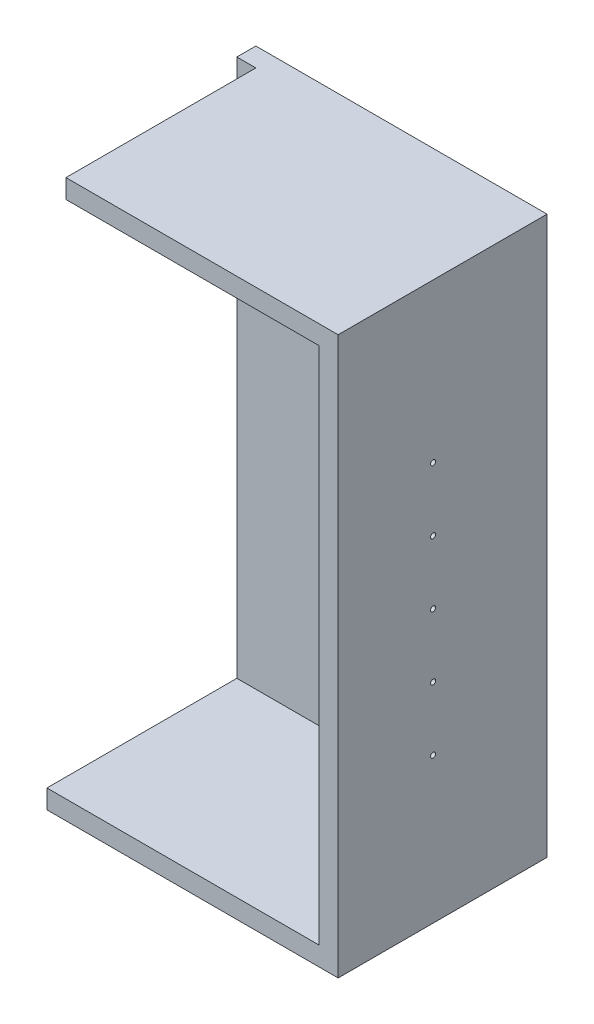
ISO-10303-21;
HEADER;
FILE_DESCRIPTION(('STEP AP214'),'2;1');
FILE_NAME('part.step','',(''),(''),'','','');
FILE_SCHEMA(('AUTOMOTIVE_DESIGN { 1 0 10303 214 1 1 1 1 }'));
ENDSEC;
DATA;
#1=APPLICATION_CONTEXT('core data for automotive mechanical design processes');
#2=APPLICATION_PROTOCOL_DEFINITION('international standard','automotive_design',2000,#1);
#3=PRODUCT_CONTEXT('',#1,'mechanical');
#4=PRODUCT('Part','Part','',(#3));
#5=PRODUCT_RELATED_PRODUCT_CATEGORY('part','',(#4));
#6=PRODUCT_DEFINITION_FORMATION('','',#4);
#7=PRODUCT_DEFINITION_CONTEXT('part definition',#1,'design');
#8=PRODUCT_DEFINITION('design','',#6,#7);
#9=PRODUCT_DEFINITION_SHAPE('','',#8);
#10=(LENGTH_UNIT() NAMED_UNIT(*) SI_UNIT(.MILLI.,.METRE.));
#11=(NAMED_UNIT(*) PLANE_ANGLE_UNIT() SI_UNIT($,.RADIAN.));
#12=(NAMED_UNIT(*) SI_UNIT($,.STERADIAN.) SOLID_ANGLE_UNIT());
#13=UNCERTAINTY_MEASURE_WITH_UNIT(LENGTH_MEASURE(1.E-05),#10,'distance_accuracy_value','');
#14=(GEOMETRIC_REPRESENTATION_CONTEXT(3) GLOBAL_UNCERTAINTY_ASSIGNED_CONTEXT((#13)) GLOBAL_UNIT_ASSIGNED_CONTEXT((#10,
#11,#12)) REPRESENTATION_CONTEXT('',''));
#15=CARTESIAN_POINT('',(0.,0.,0.));
#16=DIRECTION('',(0.,0.,1.));
#17=DIRECTION('',(1.,0.,0.));
#18=AXIS2_PLACEMENT_3D('',#15,#16,#17);
#19=CARTESIAN_POINT('',(0.,0.,300.));
#20=DIRECTION('',(0.,0.,1.));
#21=DIRECTION('',(1.,0.,0.));
#22=AXIS2_PLACEMENT_3D('',#19,#20,#21);
#23=PLANE('',#22);
#24=DIRECTION('',(1.,0.,0.));
#25=VECTOR('',#24,1.);
#26=CARTESIAN_POINT('',(-200.,-410.,300.));
#27=LINE('',#26,#25);
#28=CARTESIAN_POINT('',(-230.,-410.,300.));
#29=VERTEX_POINT('',#28);
#30=CARTESIAN_POINT('',(200.,-410.,300.));
#31=VERTEX_POINT('',#30);
#32=EDGE_CURVE('E163',#29,#31,#27,.T.);
#33=ORIENTED_EDGE('',*,*,#32,.F.);
#34=DIRECTION('',(0.,-1.,0.));
#35=VECTOR('',#34,1.);
#36=CARTESIAN_POINT('',(-230.,-440.,300.));
#37=LINE('',#36,#35);
#38=CARTESIAN_POINT('',(-230.,-440.,300.));
#39=VERTEX_POINT('',#38);
#40=EDGE_CURVE('E48',#29,#39,#37,.T.);
#41=ORIENTED_EDGE('',*,*,#40,.T.);
#42=DIRECTION('',(1.,0.,0.));
#43=VECTOR('',#42,1.);
#44=CARTESIAN_POINT('',(-230.,-440.,300.));
#45=LINE('',#44,#43);
#46=CARTESIAN_POINT('',(230.,-440.,300.));
#47=VERTEX_POINT('',#46);
#48=EDGE_CURVE('E124',#39,#47,#45,.T.);
#49=ORIENTED_EDGE('',*,*,#48,.T.);
#50=DIRECTION('',(0.,1.,0.));
#51=VECTOR('',#50,1.);
#52=CARTESIAN_POINT('',(230.,-440.,300.));
#53=LINE('',#52,#51);
#54=CARTESIAN_POINT('',(230.,440.,300.));
#55=VERTEX_POINT('',#54);
#56=EDGE_CURVE('E54',#47,#55,#53,.T.);
#57=ORIENTED_EDGE('',*,*,#56,.T.);
#58=DIRECTION('',(-1.,0.,0.));
#59=VECTOR('',#58,1.);
#60=CARTESIAN_POINT('',(-230.,440.,300.));
#61=LINE('',#60,#59);
#62=CARTESIAN_POINT('',(-200.,440.,300.));
#63=VERTEX_POINT('',#62);
#64=EDGE_CURVE('E118',#55,#63,#61,.T.);
#65=ORIENTED_EDGE('',*,*,#64,.T.);
#66=DIRECTION('',(0.,1.,0.));
#67=VECTOR('',#66,1.);
#68=CARTESIAN_POINT('',(-200.,440.,300.));
#69=LINE('',#68,#67);
#70=CARTESIAN_POINT('',(-200.,410.,300.));
#71=VERTEX_POINT('',#70);
#72=EDGE_CURVE('E103',#71,#63,#69,.T.);
#73=ORIENTED_EDGE('',*,*,#72,.F.);
#74=DIRECTION('',(-1.,0.,0.));
#75=VECTOR('',#74,1.);
#76=CARTESIAN_POINT('',(-200.,410.,300.));
#77=LINE('',#76,#75);
#78=CARTESIAN_POINT('',(200.,410.,300.));
#79=VERTEX_POINT('',#78);
#80=EDGE_CURVE('E160',#79,#71,#77,.T.);
#81=ORIENTED_EDGE('',*,*,#80,.F.);
#82=DIRECTION('',(0.,1.,0.));
#83=VECTOR('',#82,1.);
#84=CARTESIAN_POINT('',(200.,-410.,300.));
#85=LINE('',#84,#83);
#86=EDGE_CURVE('E158',#31,#79,#85,.T.);
#87=ORIENTED_EDGE('',*,*,#86,.F.);
#88=EDGE_LOOP('',(#33,#41,#49,#57,#65,#73,#81,#87));
#89=FACE_BOUND('',#88,.T.);
#90=ADVANCED_FACE('F33',(#89),#23,.T.);
#91=CARTESIAN_POINT('',(-230.,-440.,300.));
#92=DIRECTION('',(0.,1.,0.));
#93=DIRECTION('',(0.,0.,1.));
#94=AXIS2_PLACEMENT_3D('',#91,#92,#93);
#95=PLANE('',#94);
#96=DIRECTION('',(0.,0.,-1.));
#97=VECTOR('',#96,1.);
#98=CARTESIAN_POINT('',(-230.,-440.,300.));
#99=LINE('',#98,#97);
#100=CARTESIAN_POINT('',(-230.,-440.,-30.));
#101=VERTEX_POINT('',#100);
#102=EDGE_CURVE('E122',#39,#101,#99,.T.);
#103=ORIENTED_EDGE('',*,*,#102,.T.);
#104=DIRECTION('',(-1.,0.,0.));
#105=VECTOR('',#104,1.);
#106=CARTESIAN_POINT('',(230.,-440.,-30.));
#107=LINE('',#106,#105);
#108=CARTESIAN_POINT('',(230.,-440.,-30.));
#109=VERTEX_POINT('',#108);
#110=EDGE_CURVE('E148',#109,#101,#107,.T.);
#111=ORIENTED_EDGE('',*,*,#110,.F.);
#112=DIRECTION('',(0.,0.,-1.));
#113=VECTOR('',#112,1.);
#114=CARTESIAN_POINT('',(230.,-440.,300.));
#115=LINE('',#114,#113);
#116=EDGE_CURVE('E11',#47,#109,#115,.T.);
#117=ORIENTED_EDGE('',*,*,#116,.F.);
#118=ORIENTED_EDGE('',*,*,#48,.F.);
#119=EDGE_LOOP('',(#103,#111,#117,#118));
#120=FACE_BOUND('',#119,.T.);
#121=ADVANCED_FACE('F35',(#120),#95,.F.);
#122=CARTESIAN_POINT('',(230.,-440.,300.));
#123=DIRECTION('',(-1.,0.,0.));
#124=DIRECTION('',(0.,-1.,0.));
#125=AXIS2_PLACEMENT_3D('',#122,#123,#124);
#126=PLANE('',#125);
#127=CARTESIAN_POINT('',(230.,-210.,150.));
#128=DIRECTION('',(1.,0.,0.));
#129=DIRECTION('',(0.,1.,0.));
#130=AXIS2_PLACEMENT_3D('',#127,#128,#129);
#131=CIRCLE('',#130,3.99999999999999);
#132=CARTESIAN_POINT('',(230.,-206.,150.));
#133=VERTEX_POINT('',#132);
#134=EDGE_CURVE('E189',#133,#133,#131,.T.);
#135=ORIENTED_EDGE('',*,*,#134,.F.);
#136=EDGE_LOOP('',(#135));
#137=FACE_BOUND('',#136,.T.);
#138=CARTESIAN_POINT('',(230.,-110.,150.));
#139=DIRECTION('',(1.,0.,0.));
#140=DIRECTION('',(0.,1.,0.));
#141=AXIS2_PLACEMENT_3D('',#138,#139,#140);
#142=CIRCLE('',#141,3.99999999999999);
#143=CARTESIAN_POINT('',(230.,-106.,150.));
#144=VERTEX_POINT('',#143);
#145=EDGE_CURVE('E199',#144,#144,#142,.T.);
#146=ORIENTED_EDGE('',*,*,#145,.F.);
#147=EDGE_LOOP('',(#146));
#148=FACE_BOUND('',#147,.T.);
#149=CARTESIAN_POINT('',(230.,-10.0000000000001,150.));
#150=DIRECTION('',(1.,0.,0.));
#151=DIRECTION('',(0.,1.,0.));
#152=AXIS2_PLACEMENT_3D('',#149,#150,#151);
#153=CIRCLE('',#152,3.99999999999999);
#154=CARTESIAN_POINT('',(230.,-6.00000000000012,150.));
#155=VERTEX_POINT('',#154);
#156=EDGE_CURVE('E205',#155,#155,#153,.T.);
#157=ORIENTED_EDGE('',*,*,#156,.F.);
#158=EDGE_LOOP('',(#157));
#159=FACE_BOUND('',#158,.T.);
#160=CARTESIAN_POINT('',(230.,89.9999999999999,150.));
#161=DIRECTION('',(1.,0.,0.));
#162=DIRECTION('',(0.,1.,0.));
#163=AXIS2_PLACEMENT_3D('',#160,#161,#162);
#164=CIRCLE('',#163,3.99999999999999);
#165=CARTESIAN_POINT('',(230.,93.9999999999999,150.));
#166=VERTEX_POINT('',#165);
#167=EDGE_CURVE('E211',#166,#166,#164,.T.);
#168=ORIENTED_EDGE('',*,*,#167,.F.);
#169=EDGE_LOOP('',(#168));
#170=FACE_BOUND('',#169,.T.);
#171=CARTESIAN_POINT('',(230.,190.,150.));
#172=DIRECTION('',(1.,0.,0.));
#173=DIRECTION('',(0.,1.,0.));
#174=AXIS2_PLACEMENT_3D('',#171,#172,#173);
#175=CIRCLE('',#174,3.99999999999999);
#176=CARTESIAN_POINT('',(230.,194.,150.));
#177=VERTEX_POINT('',#176);
#178=EDGE_CURVE('E153',#177,#177,#175,.T.);
#179=ORIENTED_EDGE('',*,*,#178,.F.);
#180=EDGE_LOOP('',(#179));
#181=FACE_BOUND('',#180,.T.);
#182=ORIENTED_EDGE('',*,*,#116,.T.);
#183=DIRECTION('',(0.,-1.,0.));
#184=VECTOR('',#183,1.);
#185=CARTESIAN_POINT('',(230.,440.,-30.));
#186=LINE('',#185,#184);
#187=CARTESIAN_POINT('',(230.,440.,-30.));
#188=VERTEX_POINT('',#187);
#189=EDGE_CURVE('E140',#188,#109,#186,.T.);
#190=ORIENTED_EDGE('',*,*,#189,.F.);
#191=DIRECTION('',(0.,0.,-1.));
#192=VECTOR('',#191,1.);
#193=CARTESIAN_POINT('',(230.,440.,300.));
#194=LINE('',#193,#192);
#195=EDGE_CURVE('E41',#55,#188,#194,.T.);
#196=ORIENTED_EDGE('',*,*,#195,.F.);
#197=ORIENTED_EDGE('',*,*,#56,.F.);
#198=EDGE_LOOP('',(#182,#190,#196,#197));
#199=FACE_BOUND('',#198,.T.);
#200=ADVANCED_FACE('F145',(#137,#148,#159,#170,#181,#199),#126,.F.);
#201=CARTESIAN_POINT('',(-230.,440.,300.));
#202=DIRECTION('',(0.,-1.,0.));
#203=DIRECTION('',(1.,0.,0.));
#204=AXIS2_PLACEMENT_3D('',#201,#202,#203);
#205=PLANE('',#204);
#206=DIRECTION('',(0.,0.,-1.));
#207=VECTOR('',#206,1.);
#208=CARTESIAN_POINT('',(-230.,440.,300.));
#209=LINE('',#208,#207);
#210=CARTESIAN_POINT('',(-230.,440.,0.));
#211=VERTEX_POINT('',#210);
#212=CARTESIAN_POINT('',(-230.,440.,-30.));
#213=VERTEX_POINT('',#212);
#214=EDGE_CURVE('E129',#211,#213,#209,.T.);
#215=ORIENTED_EDGE('',*,*,#214,.F.);
#216=DIRECTION('',(-1.,0.,0.));
#217=VECTOR('',#216,1.);
#218=CARTESIAN_POINT('',(-230.,440.,0.));
#219=LINE('',#218,#217);
#220=CARTESIAN_POINT('',(-200.,440.,0.));
#221=VERTEX_POINT('',#220);
#222=EDGE_CURVE('E119',#221,#211,#219,.T.);
#223=ORIENTED_EDGE('',*,*,#222,.F.);
#224=DIRECTION('',(0.,0.,1.));
#225=VECTOR('',#224,1.);
#226=CARTESIAN_POINT('',(-200.,440.,-850.529246998597));
#227=LINE('',#226,#225);
#228=EDGE_CURVE('E106',#221,#63,#227,.T.);
#229=ORIENTED_EDGE('',*,*,#228,.T.);
#230=ORIENTED_EDGE('',*,*,#64,.F.);
#231=ORIENTED_EDGE('',*,*,#195,.T.);
#232=DIRECTION('',(1.,0.,0.));
#233=VECTOR('',#232,1.);
#234=CARTESIAN_POINT('',(230.,440.,-30.));
#235=LINE('',#234,#233);
#236=EDGE_CURVE('E132',#213,#188,#235,.T.);
#237=ORIENTED_EDGE('',*,*,#236,.F.);
#238=EDGE_LOOP('',(#215,#223,#229,#230,#231,#237));
#239=FACE_BOUND('',#238,.T.);
#240=ADVANCED_FACE('F117',(#239),#205,.F.);
#241=CARTESIAN_POINT('',(-230.,-440.,300.));
#242=DIRECTION('',(1.,0.,0.));
#243=DIRECTION('',(0.,0.,-1.));
#244=AXIS2_PLACEMENT_3D('',#241,#242,#243);
#245=PLANE('',#244);
#246=DIRECTION('',(0.,0.,1.));
#247=VECTOR('',#246,1.);
#248=CARTESIAN_POINT('',(-230.,-410.,-850.529246998597));
#249=LINE('',#248,#247);
#250=CARTESIAN_POINT('',(-230.,-410.,0.));
#251=VERTEX_POINT('',#250);
#252=EDGE_CURVE('E186',#251,#29,#249,.T.);
#253=ORIENTED_EDGE('',*,*,#252,.F.);
#254=DIRECTION('',(0.,-1.,0.));
#255=VECTOR('',#254,1.);
#256=CARTESIAN_POINT('',(-230.,440.,0.));
#257=LINE('',#256,#255);
#258=EDGE_CURVE('E184',#211,#251,#257,.T.);
#259=ORIENTED_EDGE('',*,*,#258,.F.);
#260=ORIENTED_EDGE('',*,*,#214,.T.);
#261=DIRECTION('',(0.,1.,0.));
#262=VECTOR('',#261,1.);
#263=CARTESIAN_POINT('',(-230.,440.,-30.));
#264=LINE('',#263,#262);
#265=EDGE_CURVE('E142',#101,#213,#264,.T.);
#266=ORIENTED_EDGE('',*,*,#265,.F.);
#267=ORIENTED_EDGE('',*,*,#102,.F.);
#268=ORIENTED_EDGE('',*,*,#40,.F.);
#269=EDGE_LOOP('',(#253,#259,#260,#266,#267,#268));
#270=FACE_BOUND('',#269,.T.);
#271=ADVANCED_FACE('F181',(#270),#245,.F.);
#272=CARTESIAN_POINT('',(200.,-410.,300.));
#273=DIRECTION('',(-1.,0.,0.));
#274=DIRECTION('',(0.,0.,1.));
#275=AXIS2_PLACEMENT_3D('',#272,#273,#274);
#276=PLANE('',#275);
#277=CARTESIAN_POINT('',(200.,-210.,150.));
#278=DIRECTION('',(-1.,0.,0.));
#279=DIRECTION('',(0.,0.,1.));
#280=AXIS2_PLACEMENT_3D('',#277,#278,#279);
#281=CIRCLE('',#280,3.99999999999999);
#282=CARTESIAN_POINT('',(200.,-210.,154.));
#283=VERTEX_POINT('',#282);
#284=EDGE_CURVE('E196',#283,#283,#281,.T.);
#285=ORIENTED_EDGE('',*,*,#284,.F.);
#286=EDGE_LOOP('',(#285));
#287=FACE_BOUND('',#286,.T.);
#288=CARTESIAN_POINT('',(200.,-110.,150.));
#289=DIRECTION('',(-1.,0.,0.));
#290=DIRECTION('',(0.,0.,1.));
#291=AXIS2_PLACEMENT_3D('',#288,#289,#290);
#292=CIRCLE('',#291,3.99999999999999);
#293=CARTESIAN_POINT('',(200.,-110.,154.));
#294=VERTEX_POINT('',#293);
#295=EDGE_CURVE('E202',#294,#294,#292,.T.);
#296=ORIENTED_EDGE('',*,*,#295,.F.);
#297=EDGE_LOOP('',(#296));
#298=FACE_BOUND('',#297,.T.);
#299=CARTESIAN_POINT('',(200.,-10.0000000000001,150.));
#300=DIRECTION('',(-1.,0.,0.));
#301=DIRECTION('',(0.,0.,1.));
#302=AXIS2_PLACEMENT_3D('',#299,#300,#301);
#303=CIRCLE('',#302,3.99999999999999);
#304=CARTESIAN_POINT('',(200.,-10.0000000000001,154.));
#305=VERTEX_POINT('',#304);
#306=EDGE_CURVE('E208',#305,#305,#303,.T.);
#307=ORIENTED_EDGE('',*,*,#306,.F.);
#308=EDGE_LOOP('',(#307));
#309=FACE_BOUND('',#308,.T.);
#310=CARTESIAN_POINT('',(200.,89.9999999999999,150.));
#311=DIRECTION('',(-1.,0.,0.));
#312=DIRECTION('',(0.,0.,1.));
#313=AXIS2_PLACEMENT_3D('',#310,#311,#312);
#314=CIRCLE('',#313,3.99999999999999);
#315=CARTESIAN_POINT('',(200.,89.9999999999999,154.));
#316=VERTEX_POINT('',#315);
#317=EDGE_CURVE('E214',#316,#316,#314,.T.);
#318=ORIENTED_EDGE('',*,*,#317,.F.);
#319=EDGE_LOOP('',(#318));
#320=FACE_BOUND('',#319,.T.);
#321=CARTESIAN_POINT('',(200.,190.,150.));
#322=DIRECTION('',(-1.,0.,0.));
#323=DIRECTION('',(0.,0.,1.));
#324=AXIS2_PLACEMENT_3D('',#321,#322,#323);
#325=CIRCLE('',#324,3.99999999999999);
#326=CARTESIAN_POINT('',(200.,190.,154.));
#327=VERTEX_POINT('',#326);
#328=EDGE_CURVE('E149',#327,#327,#325,.T.);
#329=ORIENTED_EDGE('',*,*,#328,.F.);
#330=EDGE_LOOP('',(#329));
#331=FACE_BOUND('',#330,.T.);
#332=DIRECTION('',(0.,1.,0.));
#333=VECTOR('',#332,1.);
#334=CARTESIAN_POINT('',(200.,-410.,0.));
#335=LINE('',#334,#333);
#336=CARTESIAN_POINT('',(200.,-410.,0.));
#337=VERTEX_POINT('',#336);
#338=CARTESIAN_POINT('',(200.,410.,0.));
#339=VERTEX_POINT('',#338);
#340=EDGE_CURVE('E143',#337,#339,#335,.T.);
#341=ORIENTED_EDGE('',*,*,#340,.F.);
#342=DIRECTION('',(0.,0.,-1.));
#343=VECTOR('',#342,1.);
#344=CARTESIAN_POINT('',(200.,-410.,300.));
#345=LINE('',#344,#343);
#346=EDGE_CURVE('E165',#31,#337,#345,.T.);
#347=ORIENTED_EDGE('',*,*,#346,.F.);
#348=ORIENTED_EDGE('',*,*,#86,.T.);
#349=DIRECTION('',(0.,0.,-1.));
#350=VECTOR('',#349,1.);
#351=CARTESIAN_POINT('',(200.,410.,300.));
#352=LINE('',#351,#350);
#353=EDGE_CURVE('E175',#79,#339,#352,.T.);
#354=ORIENTED_EDGE('',*,*,#353,.T.);
#355=EDGE_LOOP('',(#341,#347,#348,#354));
#356=FACE_BOUND('',#355,.T.);
#357=ADVANCED_FACE('F239',(#287,#298,#309,#320,#331,#356),#276,.T.);
#358=CARTESIAN_POINT('',(-200.,410.,300.));
#359=DIRECTION('',(0.,-1.,0.));
#360=DIRECTION('',(0.,0.,-1.));
#361=AXIS2_PLACEMENT_3D('',#358,#359,#360);
#362=PLANE('',#361);
#363=DIRECTION('',(-1.,0.,0.));
#364=VECTOR('',#363,1.);
#365=CARTESIAN_POINT('',(-200.,410.,0.));
#366=LINE('',#365,#364);
#367=CARTESIAN_POINT('',(-200.,410.,0.));
#368=VERTEX_POINT('',#367);
#369=EDGE_CURVE('E168',#339,#368,#366,.T.);
#370=ORIENTED_EDGE('',*,*,#369,.F.);
#371=ORIENTED_EDGE('',*,*,#353,.F.);
#372=ORIENTED_EDGE('',*,*,#80,.T.);
#373=DIRECTION('',(0.,0.,-1.));
#374=VECTOR('',#373,1.);
#375=CARTESIAN_POINT('',(-200.,410.,300.));
#376=LINE('',#375,#374);
#377=EDGE_CURVE('E109',#71,#368,#376,.T.);
#378=ORIENTED_EDGE('',*,*,#377,.T.);
#379=EDGE_LOOP('',(#370,#371,#372,#378));
#380=FACE_BOUND('',#379,.T.);
#381=ADVANCED_FACE('F245',(#380),#362,.T.);
#382=CARTESIAN_POINT('',(-200.,-410.,300.));
#383=DIRECTION('',(0.,1.,0.));
#384=DIRECTION('',(0.,0.,1.));
#385=AXIS2_PLACEMENT_3D('',#382,#383,#384);
#386=PLANE('',#385);
#387=DIRECTION('',(1.,0.,0.));
#388=VECTOR('',#387,1.);
#389=CARTESIAN_POINT('',(-200.,-410.,0.));
#390=LINE('',#389,#388);
#391=EDGE_CURVE('E161',#251,#337,#390,.T.);
#392=ORIENTED_EDGE('',*,*,#391,.F.);
#393=ORIENTED_EDGE('',*,*,#252,.T.);
#394=ORIENTED_EDGE('',*,*,#32,.T.);
#395=ORIENTED_EDGE('',*,*,#346,.T.);
#396=EDGE_LOOP('',(#392,#393,#394,#395));
#397=FACE_BOUND('',#396,.T.);
#398=ADVANCED_FACE('F250',(#397),#386,.T.);
#399=CARTESIAN_POINT('',(0.,0.,0.));
#400=DIRECTION('',(0.,0.,-1.));
#401=DIRECTION('',(-1.,0.,0.));
#402=AXIS2_PLACEMENT_3D('',#399,#400,#401);
#403=PLANE('',#402);
#404=ORIENTED_EDGE('',*,*,#340,.T.);
#405=ORIENTED_EDGE('',*,*,#369,.T.);
#406=DIRECTION('',(0.,1.,0.));
#407=VECTOR('',#406,1.);
#408=CARTESIAN_POINT('',(-200.,440.,0.));
#409=LINE('',#408,#407);
#410=EDGE_CURVE('E112',#368,#221,#409,.T.);
#411=ORIENTED_EDGE('',*,*,#410,.T.);
#412=ORIENTED_EDGE('',*,*,#222,.T.);
#413=ORIENTED_EDGE('',*,*,#258,.T.);
#414=ORIENTED_EDGE('',*,*,#391,.T.);
#415=EDGE_LOOP('',(#404,#405,#411,#412,#413,#414));
#416=FACE_BOUND('',#415,.T.);
#417=ADVANCED_FACE('F266',(#416),#403,.F.);
#418=CARTESIAN_POINT('',(0.,0.,-30.));
#419=DIRECTION('',(0.,0.,-1.));
#420=DIRECTION('',(-1.,0.,0.));
#421=AXIS2_PLACEMENT_3D('',#418,#419,#420);
#422=PLANE('',#421);
#423=ORIENTED_EDGE('',*,*,#189,.T.);
#424=ORIENTED_EDGE('',*,*,#110,.T.);
#425=ORIENTED_EDGE('',*,*,#265,.T.);
#426=ORIENTED_EDGE('',*,*,#236,.T.);
#427=EDGE_LOOP('',(#423,#424,#425,#426));
#428=FACE_BOUND('',#427,.T.);
#429=ADVANCED_FACE('F138',(#428),#422,.T.);
#430=CARTESIAN_POINT('',(-241.313708498985,190.,150.));
#431=DIRECTION('',(1.,0.,0.));
#432=DIRECTION('',(0.,1.,0.));
#433=AXIS2_PLACEMENT_3D('',#430,#431,#432);
#434=CYLINDRICAL_SURFACE('',#433,3.99999999999999);
#435=ORIENTED_EDGE('',*,*,#328,.T.);
#436=EDGE_LOOP('',(#435));
#437=FACE_BOUND('',#436,.T.);
#438=ORIENTED_EDGE('',*,*,#178,.T.);
#439=EDGE_LOOP('',(#438));
#440=FACE_BOUND('',#439,.T.);
#441=ADVANCED_FACE('F219',(#437,#440),#434,.F.);
#442=CARTESIAN_POINT('',(-241.313708498985,89.9999999999999,150.));
#443=DIRECTION('',(1.,0.,0.));
#444=DIRECTION('',(0.,1.,0.));
#445=AXIS2_PLACEMENT_3D('',#442,#443,#444);
#446=CYLINDRICAL_SURFACE('',#445,3.99999999999999);
#447=ORIENTED_EDGE('',*,*,#317,.T.);
#448=EDGE_LOOP('',(#447));
#449=FACE_BOUND('',#448,.T.);
#450=ORIENTED_EDGE('',*,*,#167,.T.);
#451=EDGE_LOOP('',(#450));
#452=FACE_BOUND('',#451,.T.);
#453=ADVANCED_FACE('F280',(#449,#452),#446,.F.);
#454=CARTESIAN_POINT('',(-241.313708498985,-10.0000000000001,150.));
#455=DIRECTION('',(1.,0.,0.));
#456=DIRECTION('',(0.,1.,0.));
#457=AXIS2_PLACEMENT_3D('',#454,#455,#456);
#458=CYLINDRICAL_SURFACE('',#457,3.99999999999999);
#459=ORIENTED_EDGE('',*,*,#306,.T.);
#460=EDGE_LOOP('',(#459));
#461=FACE_BOUND('',#460,.T.);
#462=ORIENTED_EDGE('',*,*,#156,.T.);
#463=EDGE_LOOP('',(#462));
#464=FACE_BOUND('',#463,.T.);
#465=ADVANCED_FACE('F284',(#461,#464),#458,.F.);
#466=CARTESIAN_POINT('',(-241.313708498985,-110.,150.));
#467=DIRECTION('',(1.,0.,0.));
#468=DIRECTION('',(0.,1.,0.));
#469=AXIS2_PLACEMENT_3D('',#466,#467,#468);
#470=CYLINDRICAL_SURFACE('',#469,3.99999999999999);
#471=ORIENTED_EDGE('',*,*,#295,.T.);
#472=EDGE_LOOP('',(#471));
#473=FACE_BOUND('',#472,.T.);
#474=ORIENTED_EDGE('',*,*,#145,.T.);
#475=EDGE_LOOP('',(#474));
#476=FACE_BOUND('',#475,.T.);
#477=ADVANCED_FACE('F288',(#473,#476),#470,.F.);
#478=CARTESIAN_POINT('',(-241.313708498985,-210.,150.));
#479=DIRECTION('',(1.,0.,0.));
#480=DIRECTION('',(0.,1.,0.));
#481=AXIS2_PLACEMENT_3D('',#478,#479,#480);
#482=CYLINDRICAL_SURFACE('',#481,3.99999999999999);
#483=ORIENTED_EDGE('',*,*,#284,.T.);
#484=EDGE_LOOP('',(#483));
#485=FACE_BOUND('',#484,.T.);
#486=ORIENTED_EDGE('',*,*,#134,.T.);
#487=EDGE_LOOP('',(#486));
#488=FACE_BOUND('',#487,.T.);
#489=ADVANCED_FACE('F292',(#485,#488),#482,.F.);
#490=CARTESIAN_POINT('',(-200.,440.,-850.529246998597));
#491=DIRECTION('',(1.,0.,0.));
#492=DIRECTION('',(0.,0.,-1.));
#493=AXIS2_PLACEMENT_3D('',#490,#491,#492);
#494=PLANE('',#493);
#495=ORIENTED_EDGE('',*,*,#377,.F.);
#496=ORIENTED_EDGE('',*,*,#72,.T.);
#497=ORIENTED_EDGE('',*,*,#228,.F.);
#498=ORIENTED_EDGE('',*,*,#410,.F.);
#499=EDGE_LOOP('',(#495,#496,#497,#498));
#500=FACE_BOUND('',#499,.T.);
#501=ADVANCED_FACE('F105',(#500),#494,.F.);
#502=CLOSED_SHELL('',(#90,#121,#200,#240,#271,#357,#381,#398,#417,#429,#441,#453,#465,#477,#489,#501));
#503=MANIFOLD_SOLID_BREP('B2',#502);
#504=ADVANCED_BREP_SHAPE_REPRESENTATION('',(#18,#503),#14);
#505=SHAPE_DEFINITION_REPRESENTATION(#9,#504);
ENDSEC;
END-ISO-10303-21;
